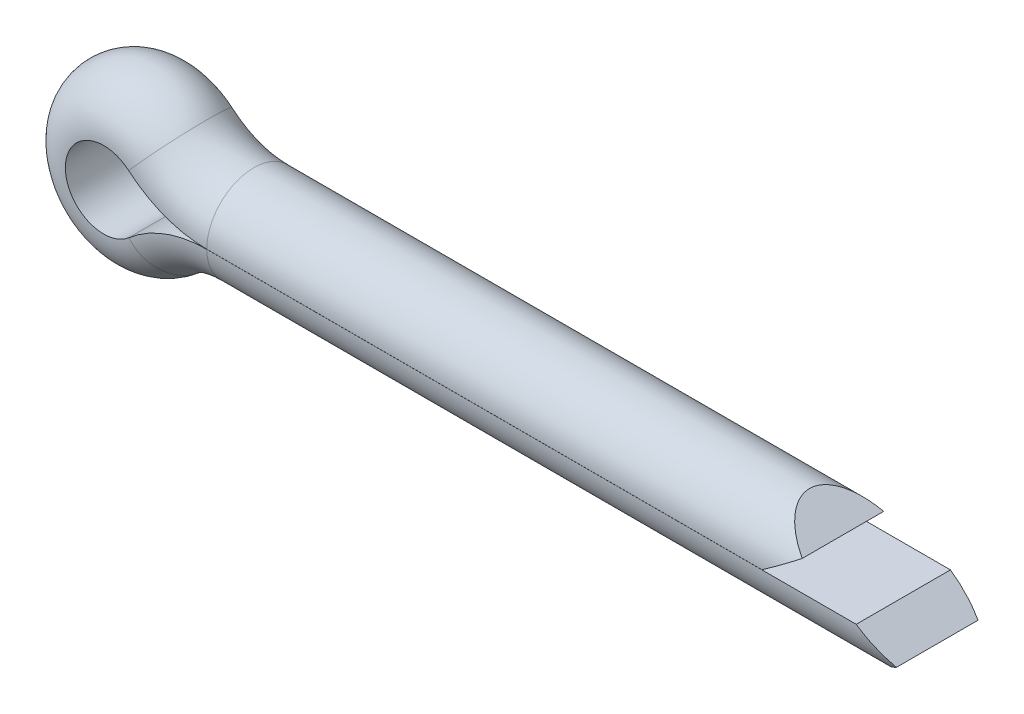
ISO-10303-21;
HEADER;
FILE_DESCRIPTION(('STEP AP214'),'2;1');
FILE_NAME('part.step','',(''),(''),'','','');
FILE_SCHEMA(('AUTOMOTIVE_DESIGN { 1 0 10303 214 1 1 1 1 }'));
ENDSEC;
DATA;
#1=APPLICATION_CONTEXT('core data for automotive mechanical design processes');
#2=APPLICATION_PROTOCOL_DEFINITION('international standard','automotive_design',2000,#1);
#3=PRODUCT_CONTEXT('',#1,'mechanical');
#4=PRODUCT('Part','Part','',(#3));
#5=PRODUCT_RELATED_PRODUCT_CATEGORY('part','',(#4));
#6=PRODUCT_DEFINITION_FORMATION('','',#4);
#7=PRODUCT_DEFINITION_CONTEXT('part definition',#1,'design');
#8=PRODUCT_DEFINITION('design','',#6,#7);
#9=PRODUCT_DEFINITION_SHAPE('','',#8);
#10=(LENGTH_UNIT() NAMED_UNIT(*) SI_UNIT(.MILLI.,.METRE.));
#11=(NAMED_UNIT(*) PLANE_ANGLE_UNIT() SI_UNIT($,.RADIAN.));
#12=(NAMED_UNIT(*) SI_UNIT($,.STERADIAN.) SOLID_ANGLE_UNIT());
#13=UNCERTAINTY_MEASURE_WITH_UNIT(LENGTH_MEASURE(1.E-05),#10,'distance_accuracy_value','');
#14=(GEOMETRIC_REPRESENTATION_CONTEXT(3) GLOBAL_UNCERTAINTY_ASSIGNED_CONTEXT((#13)) GLOBAL_UNIT_ASSIGNED_CONTEXT((#10,
#11,#12)) REPRESENTATION_CONTEXT('',''));
#15=CARTESIAN_POINT('',(0.,0.,0.));
#16=DIRECTION('',(0.,0.,1.));
#17=DIRECTION('',(1.,0.,0.));
#18=AXIS2_PLACEMENT_3D('',#15,#16,#17);
#19=CARTESIAN_POINT('',(0.,-0.00199999999999983,1.59999874999951));
#20=DIRECTION('',(0.,-1.,0.));
#21=DIRECTION('',(1.,0.,0.));
#22=AXIS2_PLACEMENT_3D('',#19,#20,#21);
#23=PLANE('',#22);
#24=DIRECTION('',(1.,0.,0.));
#25=VECTOR('',#24,1.);
#26=CARTESIAN_POINT('',(0.,-0.00199999999999983,1.59999874999951));
#27=LINE('',#26,#25);
#28=CARTESIAN_POINT('',(0.,-0.00199999999999983,1.59999874999951));
#29=VERTEX_POINT('',#28);
#30=CARTESIAN_POINT('',(22.0504175774175,-0.00199999999999907,1.59999874999951));
#31=VERTEX_POINT('',#30);
#32=EDGE_CURVE('E43',#29,#31,#27,.T.);
#33=ORIENTED_EDGE('',*,*,#32,.T.);
#34=DIRECTION('',(0.,0.,-1.));
#35=VECTOR('',#34,1.);
#36=CARTESIAN_POINT('',(22.0504175774175,-0.00199999999999901,1.59999874999951));
#37=LINE('',#36,#35);
#38=CARTESIAN_POINT('',(22.0504175774175,-0.00199999999999907,-1.59999874999951));
#39=VERTEX_POINT('',#38);
#40=EDGE_CURVE('E99',#31,#39,#37,.T.);
#41=ORIENTED_EDGE('',*,*,#40,.T.);
#42=DIRECTION('',(1.,0.,0.));
#43=VECTOR('',#42,1.);
#44=CARTESIAN_POINT('',(0.,-0.00199999999999983,-1.59999874999951));
#45=LINE('',#44,#43);
#46=CARTESIAN_POINT('',(0.,-0.00199999999999983,-1.59999874999951));
#47=VERTEX_POINT('',#46);
#48=EDGE_CURVE('E11',#47,#39,#45,.T.);
#49=ORIENTED_EDGE('',*,*,#48,.F.);
#50=DIRECTION('',(0.,0.,-1.));
#51=VECTOR('',#50,1.);
#52=CARTESIAN_POINT('',(0.,-0.00199999999999983,1.59999874999951));
#53=LINE('',#52,#51);
#54=EDGE_CURVE('E116',#29,#47,#53,.T.);
#55=ORIENTED_EDGE('',*,*,#54,.F.);
#56=EDGE_LOOP('',(#33,#41,#49,#55));
#57=FACE_BOUND('',#56,.T.);
#58=ADVANCED_FACE('F36',(#57),#23,.F.);
#59=CARTESIAN_POINT('',(0.,0.,0.));
#60=DIRECTION('',(1.,0.,0.));
#61=DIRECTION('',(0.,1.,0.));
#62=AXIS2_PLACEMENT_3D('',#59,#60,#61);
#63=CYLINDRICAL_SURFACE('',#62,1.6);
#64=CARTESIAN_POINT('',(24.3355173183374,0.,0.));
#65=DIRECTION('',(-0.576423016673743,0.817151458328712,0.));
#66=DIRECTION('',(0.817151458328712,0.576423016673743,0.));
#67=AXIS2_PLACEMENT_3D('',#64,#65,#66);
#68=ELLIPSE('',#67,2.77573926390522,1.6);
#69=CARTESIAN_POINT('',(23.2,-0.800999999999992,-1.38506281446006));
#70=VERTEX_POINT('',#69);
#71=CARTESIAN_POINT('',(23.2,-0.800999999999999,1.38506281446006));
#72=VERTEX_POINT('',#71);
#73=EDGE_CURVE('E113',#70,#72,#68,.T.);
#74=ORIENTED_EDGE('',*,*,#73,.T.);
#75=CARTESIAN_POINT('',(22.0475400244198,0.,0.));
#76=DIRECTION('',(-0.570722912676968,-0.821142714115834,0.));
#77=DIRECTION('',(0.821142714115834,-0.570722912676968,0.));
#78=AXIS2_PLACEMENT_3D('',#75,#76,#77);
#79=ELLIPSE('',#78,2.80346200312025,1.6);
#80=EDGE_CURVE('E102',#72,#31,#79,.T.);
#81=ORIENTED_EDGE('',*,*,#80,.T.);
#82=ORIENTED_EDGE('',*,*,#32,.F.);
#83=CARTESIAN_POINT('',(0.,0.,0.));
#84=DIRECTION('',(-1.,0.,0.));
#85=DIRECTION('',(0.,0.,-1.));
#86=AXIS2_PLACEMENT_3D('',#83,#84,#85);
#87=CIRCLE('',#86,1.6);
#88=EDGE_CURVE('E126',#47,#29,#87,.T.);
#89=ORIENTED_EDGE('',*,*,#88,.F.);
#90=ORIENTED_EDGE('',*,*,#48,.T.);
#91=EDGE_CURVE('E104',#39,#70,#79,.T.);
#92=ORIENTED_EDGE('',*,*,#91,.T.);
#93=EDGE_LOOP('',(#74,#81,#82,#89,#90,#92));
#94=FACE_BOUND('',#93,.T.);
#95=ADVANCED_FACE('F110',(#94),#63,.T.);
#96=CARTESIAN_POINT('',(0.,-4.06153846153847,0.));
#97=DIRECTION('',(0.,0.,-1.));
#98=DIRECTION('',(-1.,0.,0.));
#99=AXIS2_PLACEMENT_3D('',#96,#97,#98);
#100=CYLINDRICAL_SURFACE('',#99,4.05953846153847);
#101=DIRECTION('',(0.,0.,-1.));
#102=VECTOR('',#101,1.);
#103=CARTESIAN_POINT('',(-2.65005738880917,-0.986307030129112,1.59999874999951));
#104=LINE('',#103,#102);
#105=CARTESIAN_POINT('',(-2.65005738880917,-0.986307030129112,1.59999874999951));
#106=VERTEX_POINT('',#105);
#107=CARTESIAN_POINT('',(-2.65005738880917,-0.986307030129112,-1.59999874999951));
#108=VERTEX_POINT('',#107);
#109=EDGE_CURVE('E135',#106,#108,#104,.T.);
#110=ORIENTED_EDGE('',*,*,#109,.F.);
#111=CARTESIAN_POINT('',(0.,-4.06153846153847,1.59999874999951));
#112=DIRECTION('',(0.,0.,-1.));
#113=DIRECTION('',(-1.,0.,0.));
#114=AXIS2_PLACEMENT_3D('',#111,#112,#113);
#115=CIRCLE('',#114,4.05953846153847);
#116=EDGE_CURVE('E120',#106,#29,#115,.T.);
#117=ORIENTED_EDGE('',*,*,#116,.T.);
#118=ORIENTED_EDGE('',*,*,#54,.T.);
#119=CARTESIAN_POINT('',(0.,-4.06153846153847,-1.59999874999951));
#120=DIRECTION('',(0.,0.,-1.));
#121=DIRECTION('',(-1.,0.,0.));
#122=AXIS2_PLACEMENT_3D('',#119,#120,#121);
#123=CIRCLE('',#122,4.05953846153847);
#124=EDGE_CURVE('E118',#108,#47,#123,.T.);
#125=ORIENTED_EDGE('',*,*,#124,.F.);
#126=EDGE_LOOP('',(#110,#117,#118,#125));
#127=FACE_BOUND('',#126,.T.);
#128=ADVANCED_FACE('F201',(#127),#100,.T.);
#129=CARTESIAN_POINT('',(0.,-4.06153846153847,0.));
#130=DIRECTION('',(0.,0.,-1.));
#131=DIRECTION('',(-1.,0.,0.));
#132=AXIS2_PLACEMENT_3D('',#129,#130,#131);
#133=TOROIDAL_SURFACE('',#132,4.06153846153847,1.6);
#134=CARTESIAN_POINT('',(-2.65136298421806,-0.984791965566702,0.));
#135=DIRECTION('',(-0.757532281205157,-0.652797704447642,0.));
#136=DIRECTION('',(0.,0.,-1.));
#137=AXIS2_PLACEMENT_3D('',#134,#135,#136);
#138=CIRCLE('',#137,1.6);
#139=EDGE_CURVE('E138',#108,#106,#138,.T.);
#140=ORIENTED_EDGE('',*,*,#139,.F.);
#141=ORIENTED_EDGE('',*,*,#124,.T.);
#142=ORIENTED_EDGE('',*,*,#88,.T.);
#143=ORIENTED_EDGE('',*,*,#116,.F.);
#144=EDGE_LOOP('',(#140,#141,#142,#143));
#145=FACE_BOUND('',#144,.T.);
#146=ADVANCED_FACE('F203',(#145),#133,.T.);
#147=CARTESIAN_POINT('',(-3.5,0.,0.));
#148=DIRECTION('',(0.,0.,1.));
#149=DIRECTION('',(1.,0.,0.));
#150=AXIS2_PLACEMENT_3D('',#147,#148,#149);
#151=CYLINDRICAL_SURFACE('',#150,1.302);
#152=DIRECTION('',(0.,0.,-1.));
#153=VECTOR('',#152,1.);
#154=CARTESIAN_POINT('',(-2.65005738880918,0.986307030129125,1.59999874999951));
#155=LINE('',#154,#153);
#156=CARTESIAN_POINT('',(-2.65005738880918,0.986307030129125,1.59999874999951));
#157=VERTEX_POINT('',#156);
#158=CARTESIAN_POINT('',(-2.65005738880918,0.986307030129125,-1.59999874999951));
#159=VERTEX_POINT('',#158);
#160=EDGE_CURVE('E147',#157,#159,#155,.T.);
#161=ORIENTED_EDGE('',*,*,#160,.F.);
#162=CARTESIAN_POINT('',(-3.5,0.,1.59999874999951));
#163=DIRECTION('',(0.,0.,1.));
#164=DIRECTION('',(1.,0.,0.));
#165=AXIS2_PLACEMENT_3D('',#162,#163,#164);
#166=CIRCLE('',#165,1.302);
#167=EDGE_CURVE('E132',#157,#106,#166,.T.);
#168=ORIENTED_EDGE('',*,*,#167,.T.);
#169=ORIENTED_EDGE('',*,*,#109,.T.);
#170=CARTESIAN_POINT('',(-3.5,0.,-1.59999874999951));
#171=DIRECTION('',(0.,0.,1.));
#172=DIRECTION('',(1.,0.,0.));
#173=AXIS2_PLACEMENT_3D('',#170,#171,#172);
#174=CIRCLE('',#173,1.302);
#175=EDGE_CURVE('E129',#159,#108,#174,.T.);
#176=ORIENTED_EDGE('',*,*,#175,.F.);
#177=EDGE_LOOP('',(#161,#168,#169,#176));
#178=FACE_BOUND('',#177,.T.);
#179=ADVANCED_FACE('F198',(#178),#151,.F.);
#180=CARTESIAN_POINT('',(-3.5,0.,0.));
#181=DIRECTION('',(0.,0.,1.));
#182=DIRECTION('',(1.,0.,0.));
#183=AXIS2_PLACEMENT_3D('',#180,#181,#182);
#184=DEGENERATE_TOROIDAL_SURFACE('',#183,1.3,1.6,.T.);
#185=CARTESIAN_POINT('',(-2.65136298421808,0.984791965566715,0.));
#186=DIRECTION('',(0.757532281205165,-0.652797704447633,0.));
#187=DIRECTION('',(0.,0.,-1.));
#188=AXIS2_PLACEMENT_3D('',#185,#186,#187);
#189=CIRCLE('',#188,1.6);
#190=EDGE_CURVE('E150',#159,#157,#189,.T.);
#191=ORIENTED_EDGE('',*,*,#190,.F.);
#192=ORIENTED_EDGE('',*,*,#175,.T.);
#193=ORIENTED_EDGE('',*,*,#139,.T.);
#194=ORIENTED_EDGE('',*,*,#167,.F.);
#195=EDGE_LOOP('',(#191,#192,#193,#194));
#196=FACE_BOUND('',#195,.T.);
#197=ADVANCED_FACE('F195',(#196),#184,.T.);
#198=CARTESIAN_POINT('',(0.,4.06153846153847,0.));
#199=DIRECTION('',(0.,0.,-1.));
#200=DIRECTION('',(-1.,0.,0.));
#201=AXIS2_PLACEMENT_3D('',#198,#199,#200);
#202=CYLINDRICAL_SURFACE('',#201,4.05953846153847);
#203=DIRECTION('',(0.,0.,-1.));
#204=VECTOR('',#203,1.);
#205=CARTESIAN_POINT('',(0.,0.002,1.59999874999951));
#206=LINE('',#205,#204);
#207=CARTESIAN_POINT('',(0.,0.002,1.59999874999951));
#208=VERTEX_POINT('',#207);
#209=CARTESIAN_POINT('',(0.,0.002,-1.59999874999951));
#210=VERTEX_POINT('',#209);
#211=EDGE_CURVE('E157',#208,#210,#206,.T.);
#212=ORIENTED_EDGE('',*,*,#211,.F.);
#213=CARTESIAN_POINT('',(0.,4.06153846153847,1.59999874999951));
#214=DIRECTION('',(0.,0.,-1.));
#215=DIRECTION('',(-1.,0.,0.));
#216=AXIS2_PLACEMENT_3D('',#213,#214,#215);
#217=CIRCLE('',#216,4.05953846153847);
#218=EDGE_CURVE('E144',#208,#157,#217,.T.);
#219=ORIENTED_EDGE('',*,*,#218,.T.);
#220=ORIENTED_EDGE('',*,*,#160,.T.);
#221=CARTESIAN_POINT('',(0.,4.06153846153847,-1.59999874999951));
#222=DIRECTION('',(0.,0.,-1.));
#223=DIRECTION('',(-1.,0.,0.));
#224=AXIS2_PLACEMENT_3D('',#221,#222,#223);
#225=CIRCLE('',#224,4.05953846153847);
#226=EDGE_CURVE('E141',#210,#159,#225,.T.);
#227=ORIENTED_EDGE('',*,*,#226,.F.);
#228=EDGE_LOOP('',(#212,#219,#220,#227));
#229=FACE_BOUND('',#228,.T.);
#230=ADVANCED_FACE('F189',(#229),#202,.T.);
#231=CARTESIAN_POINT('',(0.,4.06153846153847,0.));
#232=DIRECTION('',(0.,0.,-1.));
#233=DIRECTION('',(-1.,0.,0.));
#234=AXIS2_PLACEMENT_3D('',#231,#232,#233);
#235=TOROIDAL_SURFACE('',#234,4.06153846153847,1.6);
#236=CARTESIAN_POINT('',(0.,0.,0.));
#237=DIRECTION('',(1.,0.,0.));
#238=DIRECTION('',(0.,0.,-1.));
#239=AXIS2_PLACEMENT_3D('',#236,#237,#238);
#240=CIRCLE('',#239,1.6);
#241=EDGE_CURVE('E162',#210,#208,#240,.T.);
#242=ORIENTED_EDGE('',*,*,#241,.F.);
#243=ORIENTED_EDGE('',*,*,#226,.T.);
#244=ORIENTED_EDGE('',*,*,#190,.T.);
#245=ORIENTED_EDGE('',*,*,#218,.F.);
#246=EDGE_LOOP('',(#242,#243,#244,#245));
#247=FACE_BOUND('',#246,.T.);
#248=ADVANCED_FACE('F192',(#247),#235,.T.);
#249=CARTESIAN_POINT('',(0.,0.,0.));
#250=DIRECTION('',(1.,0.,0.));
#251=DIRECTION('',(0.,0.,-1.));
#252=AXIS2_PLACEMENT_3D('',#249,#250,#251);
#253=CYLINDRICAL_SURFACE('',#252,1.6);
#254=CARTESIAN_POINT('',(18.8475400244198,0.,0.));
#255=DIRECTION('',(-0.570722912676969,0.821142714115833,0.));
#256=DIRECTION('',(0.821142714115834,0.570722912676969,0.));
#257=AXIS2_PLACEMENT_3D('',#254,#255,#256);
#258=ELLIPSE('',#257,2.80346200312025,1.6);
#259=CARTESIAN_POINT('',(20.,0.801,1.38506281446005));
#260=VERTEX_POINT('',#259);
#261=CARTESIAN_POINT('',(18.8504175774175,0.002,1.59999874999951));
#262=VERTEX_POINT('',#261);
#263=EDGE_CURVE('E50',#260,#262,#258,.F.);
#264=ORIENTED_EDGE('',*,*,#263,.F.);
#265=CARTESIAN_POINT('',(21.1355173183374,0.,0.));
#266=DIRECTION('',(-0.576423016673744,-0.817151458328712,0.));
#267=DIRECTION('',(0.817151458328712,-0.576423016673744,0.));
#268=AXIS2_PLACEMENT_3D('',#265,#266,#267);
#269=ELLIPSE('',#268,2.77573926390521,1.6);
#270=CARTESIAN_POINT('',(20.,0.801,-1.38506281446005));
#271=VERTEX_POINT('',#270);
#272=EDGE_CURVE('E171',#271,#260,#269,.F.);
#273=ORIENTED_EDGE('',*,*,#272,.F.);
#274=CARTESIAN_POINT('',(18.8504175774175,0.00200000000000084,-1.59999874999951));
#275=VERTEX_POINT('',#274);
#276=EDGE_CURVE('E167',#275,#271,#258,.F.);
#277=ORIENTED_EDGE('',*,*,#276,.F.);
#278=DIRECTION('',(1.,0.,0.));
#279=VECTOR('',#278,1.);
#280=CARTESIAN_POINT('',(0.,0.002,-1.59999874999951));
#281=LINE('',#280,#279);
#282=EDGE_CURVE('E153',#210,#275,#281,.T.);
#283=ORIENTED_EDGE('',*,*,#282,.F.);
#284=ORIENTED_EDGE('',*,*,#241,.T.);
#285=DIRECTION('',(1.,0.,0.));
#286=VECTOR('',#285,1.);
#287=CARTESIAN_POINT('',(0.,0.002,1.59999874999951));
#288=LINE('',#287,#286);
#289=EDGE_CURVE('E154',#208,#262,#288,.T.);
#290=ORIENTED_EDGE('',*,*,#289,.T.);
#291=EDGE_LOOP('',(#264,#273,#277,#283,#284,#290));
#292=FACE_BOUND('',#291,.T.);
#293=ADVANCED_FACE('F181',(#292),#253,.T.);
#294=CARTESIAN_POINT('',(0.,0.002,1.59999874999951));
#295=DIRECTION('',(0.,-1.,0.));
#296=DIRECTION('',(0.,0.,-1.));
#297=AXIS2_PLACEMENT_3D('',#294,#295,#296);
#298=PLANE('',#297);
#299=DIRECTION('',(0.,0.,-1.));
#300=VECTOR('',#299,1.);
#301=CARTESIAN_POINT('',(18.8504175774175,0.002,1.59999874999951));
#302=LINE('',#301,#300);
#303=EDGE_CURVE('E169',#262,#275,#302,.T.);
#304=ORIENTED_EDGE('',*,*,#303,.F.);
#305=ORIENTED_EDGE('',*,*,#289,.F.);
#306=ORIENTED_EDGE('',*,*,#211,.T.);
#307=ORIENTED_EDGE('',*,*,#282,.T.);
#308=EDGE_LOOP('',(#304,#305,#306,#307));
#309=FACE_BOUND('',#308,.T.);
#310=ADVANCED_FACE('F186',(#309),#298,.T.);
#311=CARTESIAN_POINT('',(20.,0.801,-1.59999874999951));
#312=DIRECTION('',(-0.570722912676969,0.821142714115833,0.));
#313=DIRECTION('',(-0.821142714115833,-0.570722912676969,0.));
#314=AXIS2_PLACEMENT_3D('',#311,#312,#313);
#315=PLANE('',#314);
#316=ORIENTED_EDGE('',*,*,#263,.T.);
#317=ORIENTED_EDGE('',*,*,#303,.T.);
#318=ORIENTED_EDGE('',*,*,#276,.T.);
#319=DIRECTION('',(0.,0.,1.));
#320=VECTOR('',#319,1.);
#321=CARTESIAN_POINT('',(20.,0.801,-1.59999874999951));
#322=LINE('',#321,#320);
#323=EDGE_CURVE('E173',#271,#260,#322,.T.);
#324=ORIENTED_EDGE('',*,*,#323,.T.);
#325=EDGE_LOOP('',(#316,#317,#318,#324));
#326=FACE_BOUND('',#325,.T.);
#327=ADVANCED_FACE('F176',(#326),#315,.F.);
#328=CARTESIAN_POINT('',(20.,0.801,-1.59999874999951));
#329=DIRECTION('',(-0.576423016673744,-0.817151458328712,0.));
#330=DIRECTION('',(0.817151458328712,-0.576423016673744,0.));
#331=AXIS2_PLACEMENT_3D('',#328,#329,#330);
#332=PLANE('',#331);
#333=ORIENTED_EDGE('',*,*,#272,.T.);
#334=ORIENTED_EDGE('',*,*,#323,.F.);
#335=EDGE_LOOP('',(#333,#334));
#336=FACE_BOUND('',#335,.T.);
#337=ADVANCED_FACE('F290',(#336),#332,.F.);
#338=CARTESIAN_POINT('',(23.2,-0.800999999999999,-1.59999874999951));
#339=DIRECTION('',(-0.576423016673743,0.817151458328712,0.));
#340=DIRECTION('',(-0.817151458328712,-0.576423016673743,0.));
#341=AXIS2_PLACEMENT_3D('',#338,#339,#340);
#342=PLANE('',#341);
#343=DIRECTION('',(0.,0.,1.));
#344=VECTOR('',#343,1.);
#345=CARTESIAN_POINT('',(23.2,-0.800999999999999,-1.59999874999951));
#346=LINE('',#345,#344);
#347=EDGE_CURVE('E58',#70,#72,#346,.T.);
#348=ORIENTED_EDGE('',*,*,#347,.T.);
#349=ORIENTED_EDGE('',*,*,#73,.F.);
#350=EDGE_LOOP('',(#348,#349));
#351=FACE_BOUND('',#350,.T.);
#352=ADVANCED_FACE('F299',(#351),#342,.F.);
#353=CARTESIAN_POINT('',(23.2,-0.800999999999999,-1.59999874999951));
#354=DIRECTION('',(-0.570722912676968,-0.821142714115834,0.));
#355=DIRECTION('',(0.821142714115834,-0.570722912676968,0.));
#356=AXIS2_PLACEMENT_3D('',#353,#354,#355);
#357=PLANE('',#356);
#358=ORIENTED_EDGE('',*,*,#347,.F.);
#359=ORIENTED_EDGE('',*,*,#91,.F.);
#360=ORIENTED_EDGE('',*,*,#40,.F.);
#361=ORIENTED_EDGE('',*,*,#80,.F.);
#362=EDGE_LOOP('',(#358,#359,#360,#361));
#363=FACE_BOUND('',#362,.T.);
#364=ADVANCED_FACE('F101',(#363),#357,.F.);
#365=CLOSED_SHELL('',(#58,#95,#128,#146,#179,#197,#230,#248,#293,#310,#327,#337,#352,#364));
#366=MANIFOLD_SOLID_BREP('B2',#365);
#367=ADVANCED_BREP_SHAPE_REPRESENTATION('',(#18,#366),#14);
#368=SHAPE_DEFINITION_REPRESENTATION(#9,#367);
ENDSEC;
END-ISO-10303-21;
